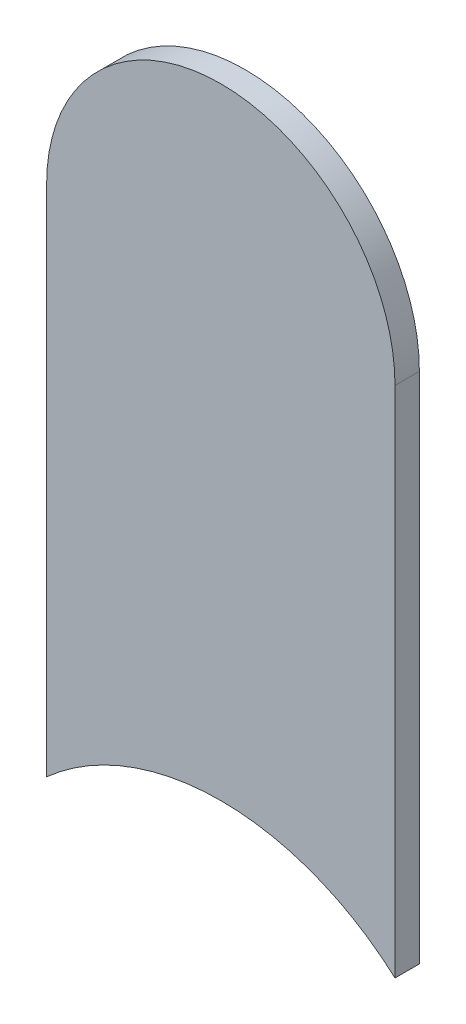
ISO-10303-21;
HEADER;
FILE_DESCRIPTION(('STEP AP214'),'2;1');
FILE_NAME('part.step','',(''),(''),'','','');
FILE_SCHEMA(('AUTOMOTIVE_DESIGN { 1 0 10303 214 1 1 1 1 }'));
ENDSEC;
DATA;
#1=APPLICATION_CONTEXT('core data for automotive mechanical design processes');
#2=APPLICATION_PROTOCOL_DEFINITION('international standard','automotive_design',2000,#1);
#3=PRODUCT_CONTEXT('',#1,'mechanical');
#4=PRODUCT('Part','Part','',(#3));
#5=PRODUCT_RELATED_PRODUCT_CATEGORY('part','',(#4));
#6=PRODUCT_DEFINITION_FORMATION('','',#4);
#7=PRODUCT_DEFINITION_CONTEXT('part definition',#1,'design');
#8=PRODUCT_DEFINITION('design','',#6,#7);
#9=PRODUCT_DEFINITION_SHAPE('','',#8);
#10=(LENGTH_UNIT() NAMED_UNIT(*) SI_UNIT(.MILLI.,.METRE.));
#11=(NAMED_UNIT(*) PLANE_ANGLE_UNIT() SI_UNIT($,.RADIAN.));
#12=(NAMED_UNIT(*) SI_UNIT($,.STERADIAN.) SOLID_ANGLE_UNIT());
#13=UNCERTAINTY_MEASURE_WITH_UNIT(LENGTH_MEASURE(1.E-05),#10,'distance_accuracy_value','');
#14=(GEOMETRIC_REPRESENTATION_CONTEXT(3) GLOBAL_UNCERTAINTY_ASSIGNED_CONTEXT((#13)) GLOBAL_UNIT_ASSIGNED_CONTEXT((#10,
#11,#12)) REPRESENTATION_CONTEXT('',''));
#15=CARTESIAN_POINT('',(0.,0.,0.));
#16=DIRECTION('',(0.,0.,1.));
#17=DIRECTION('',(1.,0.,0.));
#18=AXIS2_PLACEMENT_3D('',#15,#16,#17);
#19=CARTESIAN_POINT('',(147.57,-80.772,-0.035));
#20=DIRECTION('',(-1.,0.,0.));
#21=DIRECTION('',(0.,0.,1.));
#22=AXIS2_PLACEMENT_3D('',#19,#20,#21);
#23=PLANE('',#22);
#24=DIRECTION('',(0.,0.,1.));
#25=VECTOR('',#24,1.);
#26=CARTESIAN_POINT('',(147.57,-79.756,-0.035));
#27=LINE('',#26,#25);
#28=CARTESIAN_POINT('',(147.57,-79.756,-0.035));
#29=VERTEX_POINT('',#28);
#30=CARTESIAN_POINT('',(147.57,-79.756,0.));
#31=VERTEX_POINT('',#30);
#32=EDGE_CURVE('E11',#29,#31,#27,.T.);
#33=ORIENTED_EDGE('',*,*,#32,.T.);
#34=DIRECTION('',(0.,1.,0.));
#35=VECTOR('',#34,1.);
#36=CARTESIAN_POINT('',(147.57,-80.772,0.));
#37=LINE('',#36,#35);
#38=CARTESIAN_POINT('',(147.57,-80.49249150281,0.));
#39=VERTEX_POINT('',#38);
#40=EDGE_CURVE('E20',#39,#31,#37,.T.);
#41=ORIENTED_EDGE('',*,*,#40,.F.);
#42=DIRECTION('',(0.,0.,-1.));
#43=VECTOR('',#42,1.);
#44=CARTESIAN_POINT('',(147.57,-80.49249150281,-0.045));
#45=LINE('',#44,#43);
#46=CARTESIAN_POINT('',(147.57,-80.49249150281,-0.035));
#47=VERTEX_POINT('',#46);
#48=EDGE_CURVE('E55',#39,#47,#45,.T.);
#49=ORIENTED_EDGE('',*,*,#48,.T.);
#50=DIRECTION('',(0.,1.,0.));
#51=VECTOR('',#50,1.);
#52=CARTESIAN_POINT('',(147.57,-80.772,-0.035));
#53=LINE('',#52,#51);
#54=EDGE_CURVE('E58',#47,#29,#53,.T.);
#55=ORIENTED_EDGE('',*,*,#54,.T.);
#56=EDGE_LOOP('',(#33,#41,#49,#55));
#57=FACE_BOUND('',#56,.T.);
#58=ADVANCED_FACE('F17',(#57),#23,.F.);
#59=CARTESIAN_POINT('',(147.32,-79.756,-0.035));
#60=DIRECTION('',(0.,0.,-1.));
#61=DIRECTION('',(1.,0.,0.));
#62=AXIS2_PLACEMENT_3D('',#59,#60,#61);
#63=CYLINDRICAL_SURFACE('',#62,0.25);
#64=CARTESIAN_POINT('',(147.32,-79.756,-0.035));
#65=DIRECTION('',(0.,0.,1.));
#66=DIRECTION('',(1.,0.,0.));
#67=AXIS2_PLACEMENT_3D('',#64,#65,#66);
#68=CIRCLE('',#67,0.25);
#69=CARTESIAN_POINT('',(147.07,-79.756,-0.035));
#70=VERTEX_POINT('',#69);
#71=EDGE_CURVE('E77',#29,#70,#68,.T.);
#72=ORIENTED_EDGE('',*,*,#71,.T.);
#73=DIRECTION('',(0.,0.,1.));
#74=VECTOR('',#73,1.);
#75=CARTESIAN_POINT('',(147.07,-79.756,-0.035));
#76=LINE('',#75,#74);
#77=CARTESIAN_POINT('',(147.07,-79.756,0.));
#78=VERTEX_POINT('',#77);
#79=EDGE_CURVE('E88',#70,#78,#76,.T.);
#80=ORIENTED_EDGE('',*,*,#79,.T.);
#81=CARTESIAN_POINT('',(147.32,-79.756,0.));
#82=DIRECTION('',(0.,0.,1.));
#83=DIRECTION('',(1.,0.,0.));
#84=AXIS2_PLACEMENT_3D('',#81,#82,#83);
#85=CIRCLE('',#84,0.25);
#86=EDGE_CURVE('E63',#31,#78,#85,.T.);
#87=ORIENTED_EDGE('',*,*,#86,.F.);
#88=ORIENTED_EDGE('',*,*,#32,.F.);
#89=EDGE_LOOP('',(#72,#80,#87,#88));
#90=FACE_BOUND('',#89,.T.);
#91=ADVANCED_FACE('F101',(#90),#63,.T.);
#92=CARTESIAN_POINT('',(147.07,-79.756,0.));
#93=DIRECTION('',(0.,0.,1.));
#94=DIRECTION('',(1.,0.,0.));
#95=AXIS2_PLACEMENT_3D('',#92,#93,#94);
#96=PLANE('',#95);
#97=ORIENTED_EDGE('',*,*,#86,.T.);
#98=DIRECTION('',(0.,-1.,0.));
#99=VECTOR('',#98,1.);
#100=CARTESIAN_POINT('',(147.07,-79.756,0.));
#101=LINE('',#100,#99);
#102=CARTESIAN_POINT('',(147.07,-80.49249150281,0.));
#103=VERTEX_POINT('',#102);
#104=EDGE_CURVE('E107',#78,#103,#101,.T.);
#105=ORIENTED_EDGE('',*,*,#104,.T.);
#106=CARTESIAN_POINT('',(147.32,-80.772,0.));
#107=DIRECTION('',(0.,0.,-1.));
#108=DIRECTION('',(0.,-1.,0.));
#109=AXIS2_PLACEMENT_3D('',#106,#107,#108);
#110=CIRCLE('',#109,0.375);
#111=EDGE_CURVE('E64',#103,#39,#110,.T.);
#112=ORIENTED_EDGE('',*,*,#111,.T.);
#113=ORIENTED_EDGE('',*,*,#40,.T.);
#114=EDGE_LOOP('',(#97,#105,#112,#113));
#115=FACE_BOUND('',#114,.T.);
#116=ADVANCED_FACE('F124',(#115),#96,.T.);
#117=CARTESIAN_POINT('',(147.32,-80.772,-0.045));
#118=DIRECTION('',(0.,0.,-1.));
#119=DIRECTION('',(0.,-1.,0.));
#120=AXIS2_PLACEMENT_3D('',#117,#118,#119);
#121=CYLINDRICAL_SURFACE('',#120,0.375);
#122=ORIENTED_EDGE('',*,*,#111,.F.);
#123=DIRECTION('',(0.,0.,-1.));
#124=VECTOR('',#123,1.);
#125=CARTESIAN_POINT('',(147.07,-80.49249150281,-0.045));
#126=LINE('',#125,#124);
#127=CARTESIAN_POINT('',(147.07,-80.49249150281,-0.035));
#128=VERTEX_POINT('',#127);
#129=EDGE_CURVE('E72',#103,#128,#126,.T.);
#130=ORIENTED_EDGE('',*,*,#129,.T.);
#131=CARTESIAN_POINT('',(147.32,-80.772,-0.035));
#132=DIRECTION('',(0.,0.,-1.));
#133=DIRECTION('',(0.,-1.,0.));
#134=AXIS2_PLACEMENT_3D('',#131,#132,#133);
#135=CIRCLE('',#134,0.375);
#136=EDGE_CURVE('E68',#128,#47,#135,.T.);
#137=ORIENTED_EDGE('',*,*,#136,.T.);
#138=ORIENTED_EDGE('',*,*,#48,.F.);
#139=EDGE_LOOP('',(#122,#130,#137,#138));
#140=FACE_BOUND('',#139,.T.);
#141=ADVANCED_FACE('F69',(#140),#121,.F.);
#142=CARTESIAN_POINT('',(147.07,-79.756,-0.035));
#143=DIRECTION('',(0.,0.,1.));
#144=DIRECTION('',(1.,0.,0.));
#145=AXIS2_PLACEMENT_3D('',#142,#143,#144);
#146=PLANE('',#145);
#147=ORIENTED_EDGE('',*,*,#54,.F.);
#148=ORIENTED_EDGE('',*,*,#136,.F.);
#149=DIRECTION('',(0.,-1.,0.));
#150=VECTOR('',#149,1.);
#151=CARTESIAN_POINT('',(147.07,-79.756,-0.035));
#152=LINE('',#151,#150);
#153=EDGE_CURVE('E82',#70,#128,#152,.T.);
#154=ORIENTED_EDGE('',*,*,#153,.F.);
#155=ORIENTED_EDGE('',*,*,#71,.F.);
#156=EDGE_LOOP('',(#147,#148,#154,#155));
#157=FACE_BOUND('',#156,.T.);
#158=ADVANCED_FACE('F80',(#157),#146,.F.);
#159=CARTESIAN_POINT('',(147.07,-79.756,-0.035));
#160=DIRECTION('',(1.,0.,0.));
#161=DIRECTION('',(0.,1.,0.));
#162=AXIS2_PLACEMENT_3D('',#159,#160,#161);
#163=PLANE('',#162);
#164=ORIENTED_EDGE('',*,*,#129,.F.);
#165=ORIENTED_EDGE('',*,*,#104,.F.);
#166=ORIENTED_EDGE('',*,*,#79,.F.);
#167=ORIENTED_EDGE('',*,*,#153,.T.);
#168=EDGE_LOOP('',(#164,#165,#166,#167));
#169=FACE_BOUND('',#168,.T.);
#170=ADVANCED_FACE('F106',(#169),#163,.F.);
#171=CLOSED_SHELL('',(#58,#91,#116,#141,#158,#170));
#172=MANIFOLD_SOLID_BREP('B1',#171);
#173=ADVANCED_BREP_SHAPE_REPRESENTATION('',(#18,#172),#14);
#174=SHAPE_DEFINITION_REPRESENTATION(#9,#173);
ENDSEC;
END-ISO-10303-21;
